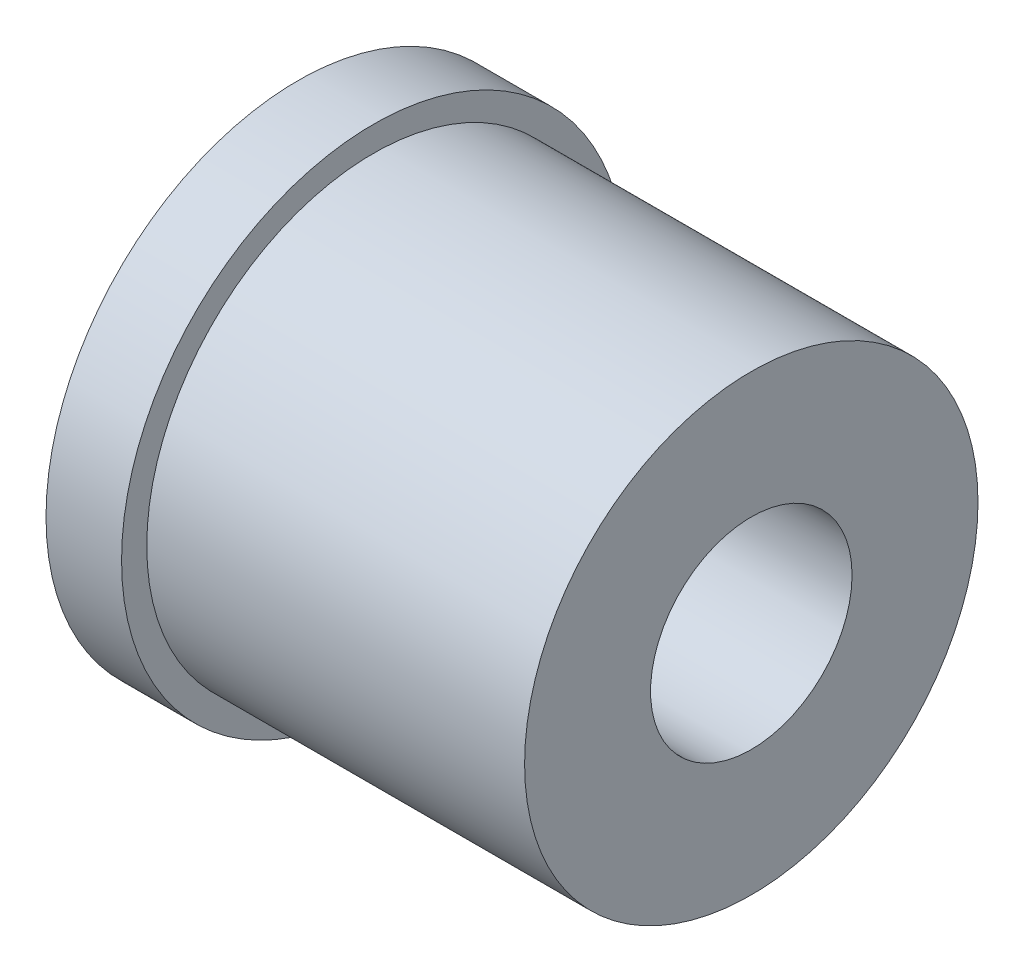
ISO-10303-21;
HEADER;
FILE_DESCRIPTION(('STEP AP214'),'2;1');
FILE_NAME('part.step','',(''),(''),'','','');
FILE_SCHEMA(('AUTOMOTIVE_DESIGN { 1 0 10303 214 1 1 1 1 }'));
ENDSEC;
DATA;
#1=APPLICATION_CONTEXT('core data for automotive mechanical design processes');
#2=APPLICATION_PROTOCOL_DEFINITION('international standard','automotive_design',2000,#1);
#3=PRODUCT_CONTEXT('',#1,'mechanical');
#4=PRODUCT('Part','Part','',(#3));
#5=PRODUCT_RELATED_PRODUCT_CATEGORY('part','',(#4));
#6=PRODUCT_DEFINITION_FORMATION('','',#4);
#7=PRODUCT_DEFINITION_CONTEXT('part definition',#1,'design');
#8=PRODUCT_DEFINITION('design','',#6,#7);
#9=PRODUCT_DEFINITION_SHAPE('','',#8);
#10=(LENGTH_UNIT() NAMED_UNIT(*) SI_UNIT(.MILLI.,.METRE.));
#11=(NAMED_UNIT(*) PLANE_ANGLE_UNIT() SI_UNIT($,.RADIAN.));
#12=(NAMED_UNIT(*) SI_UNIT($,.STERADIAN.) SOLID_ANGLE_UNIT());
#13=UNCERTAINTY_MEASURE_WITH_UNIT(LENGTH_MEASURE(1.E-05),#10,'distance_accuracy_value','');
#14=(GEOMETRIC_REPRESENTATION_CONTEXT(3) GLOBAL_UNCERTAINTY_ASSIGNED_CONTEXT((#13)) GLOBAL_UNIT_ASSIGNED_CONTEXT((#10,
#11,#12)) REPRESENTATION_CONTEXT('',''));
#15=CARTESIAN_POINT('',(0.,0.,0.));
#16=DIRECTION('',(0.,0.,1.));
#17=DIRECTION('',(1.,0.,0.));
#18=AXIS2_PLACEMENT_3D('',#15,#16,#17);
#19=CARTESIAN_POINT('',(4.5,0.,0.));
#20=DIRECTION('',(-1.,0.,0.));
#21=DIRECTION('',(0.,0.,1.));
#22=AXIS2_PLACEMENT_3D('',#19,#20,#21);
#23=CYLINDRICAL_SURFACE('',#22,2.25);
#24=CARTESIAN_POINT('',(4.5,0.,0.));
#25=DIRECTION('',(1.,0.,0.));
#26=DIRECTION('',(0.,0.,-1.));
#27=AXIS2_PLACEMENT_3D('',#24,#25,#26);
#28=CIRCLE('',#27,2.25);
#29=CARTESIAN_POINT('',(4.5,0.,-2.25));
#30=VERTEX_POINT('',#29);
#31=EDGE_CURVE('E38',#30,#30,#28,.T.);
#32=ORIENTED_EDGE('',*,*,#31,.F.);
#33=EDGE_LOOP('',(#32));
#34=FACE_BOUND('',#33,.T.);
#35=CARTESIAN_POINT('',(0.75,0.,0.));
#36=DIRECTION('',(-1.,0.,0.));
#37=DIRECTION('',(0.,0.,1.));
#38=AXIS2_PLACEMENT_3D('',#35,#36,#37);
#39=CIRCLE('',#38,2.25);
#40=CARTESIAN_POINT('',(0.75,0.,2.25));
#41=VERTEX_POINT('',#40);
#42=EDGE_CURVE('E10',#41,#41,#39,.T.);
#43=ORIENTED_EDGE('',*,*,#42,.F.);
#44=EDGE_LOOP('',(#43));
#45=FACE_BOUND('',#44,.T.);
#46=ADVANCED_FACE('F32',(#34,#45),#23,.T.);
#47=CARTESIAN_POINT('',(4.5,0.,0.));
#48=DIRECTION('',(1.,0.,0.));
#49=DIRECTION('',(0.,0.,-1.));
#50=AXIS2_PLACEMENT_3D('',#47,#48,#49);
#51=PLANE('',#50);
#52=ORIENTED_EDGE('',*,*,#31,.T.);
#53=EDGE_LOOP('',(#52));
#54=FACE_BOUND('',#53,.T.);
#55=CARTESIAN_POINT('',(4.5,0.,0.));
#56=DIRECTION('',(1.,0.,0.));
#57=DIRECTION('',(0.,0.,-1.));
#58=AXIS2_PLACEMENT_3D('',#55,#56,#57);
#59=CIRCLE('',#58,1.);
#60=CARTESIAN_POINT('',(4.5,0.,-1.));
#61=VERTEX_POINT('',#60);
#62=EDGE_CURVE('E42',#61,#61,#59,.T.);
#63=ORIENTED_EDGE('',*,*,#62,.F.);
#64=EDGE_LOOP('',(#63));
#65=FACE_BOUND('',#64,.T.);
#66=ADVANCED_FACE('F70',(#54,#65),#51,.T.);
#67=CARTESIAN_POINT('',(0.,0.,0.));
#68=DIRECTION('',(1.,0.,0.));
#69=DIRECTION('',(0.,0.,-1.));
#70=AXIS2_PLACEMENT_3D('',#67,#68,#69);
#71=PLANE('',#70);
#72=CARTESIAN_POINT('',(0.,0.,0.));
#73=DIRECTION('',(1.,0.,0.));
#74=DIRECTION('',(0.,0.,-1.));
#75=AXIS2_PLACEMENT_3D('',#72,#73,#74);
#76=CIRCLE('',#75,1.);
#77=CARTESIAN_POINT('',(0.,0.,-1.));
#78=VERTEX_POINT('',#77);
#79=EDGE_CURVE('E46',#78,#78,#76,.T.);
#80=ORIENTED_EDGE('',*,*,#79,.T.);
#81=EDGE_LOOP('',(#80));
#82=FACE_BOUND('',#81,.T.);
#83=CARTESIAN_POINT('',(0.,0.,0.));
#84=DIRECTION('',(-1.,0.,0.));
#85=DIRECTION('',(0.,0.,1.));
#86=AXIS2_PLACEMENT_3D('',#83,#84,#85);
#87=CIRCLE('',#86,2.5);
#88=CARTESIAN_POINT('',(0.,0.,2.5));
#89=VERTEX_POINT('',#88);
#90=EDGE_CURVE('E52',#89,#89,#87,.T.);
#91=ORIENTED_EDGE('',*,*,#90,.T.);
#92=EDGE_LOOP('',(#91));
#93=FACE_BOUND('',#92,.T.);
#94=ADVANCED_FACE('F75',(#82,#93),#71,.F.);
#95=CARTESIAN_POINT('',(4.5,0.,0.));
#96=DIRECTION('',(-1.,0.,0.));
#97=DIRECTION('',(0.,0.,1.));
#98=AXIS2_PLACEMENT_3D('',#95,#96,#97);
#99=CYLINDRICAL_SURFACE('',#98,1.);
#100=ORIENTED_EDGE('',*,*,#62,.T.);
#101=EDGE_LOOP('',(#100));
#102=FACE_BOUND('',#101,.T.);
#103=ORIENTED_EDGE('',*,*,#79,.F.);
#104=EDGE_LOOP('',(#103));
#105=FACE_BOUND('',#104,.T.);
#106=ADVANCED_FACE('F67',(#102,#105),#99,.F.);
#107=CARTESIAN_POINT('',(0.75,0.,0.));
#108=DIRECTION('',(-1.,0.,0.));
#109=DIRECTION('',(0.,0.,1.));
#110=AXIS2_PLACEMENT_3D('',#107,#108,#109);
#111=CYLINDRICAL_SURFACE('',#110,2.5);
#112=CARTESIAN_POINT('',(0.75,0.,0.));
#113=DIRECTION('',(-1.,0.,0.));
#114=DIRECTION('',(0.,0.,1.));
#115=AXIS2_PLACEMENT_3D('',#112,#113,#114);
#116=CIRCLE('',#115,2.5);
#117=CARTESIAN_POINT('',(0.75,0.,2.5));
#118=VERTEX_POINT('',#117);
#119=EDGE_CURVE('E50',#118,#118,#116,.T.);
#120=ORIENTED_EDGE('',*,*,#119,.T.);
#121=EDGE_LOOP('',(#120));
#122=FACE_BOUND('',#121,.T.);
#123=ORIENTED_EDGE('',*,*,#90,.F.);
#124=EDGE_LOOP('',(#123));
#125=FACE_BOUND('',#124,.T.);
#126=ADVANCED_FACE('F58',(#122,#125),#111,.T.);
#127=CARTESIAN_POINT('',(0.75,0.,0.));
#128=DIRECTION('',(-1.,0.,0.));
#129=DIRECTION('',(0.,0.,1.));
#130=AXIS2_PLACEMENT_3D('',#127,#128,#129);
#131=PLANE('',#130);
#132=ORIENTED_EDGE('',*,*,#42,.T.);
#133=EDGE_LOOP('',(#132));
#134=FACE_BOUND('',#133,.T.);
#135=ORIENTED_EDGE('',*,*,#119,.F.);
#136=EDGE_LOOP('',(#135));
#137=FACE_BOUND('',#136,.T.);
#138=ADVANCED_FACE('F61',(#134,#137),#131,.F.);
#139=CLOSED_SHELL('',(#46,#66,#94,#106,#126,#138));
#140=MANIFOLD_SOLID_BREP('B2',#139);
#141=ADVANCED_BREP_SHAPE_REPRESENTATION('',(#18,#140),#14);
#142=SHAPE_DEFINITION_REPRESENTATION(#9,#141);
ENDSEC;
END-ISO-10303-21;
